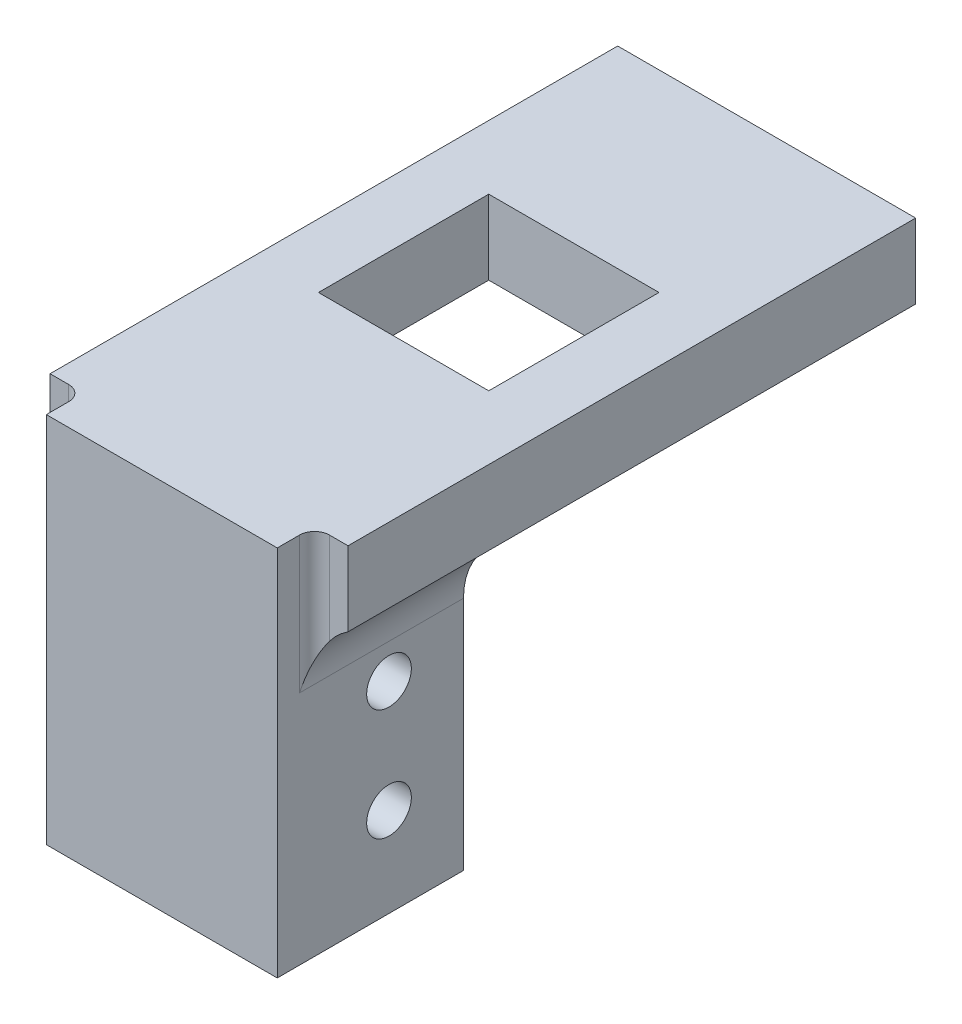
ISO-10303-21;
HEADER;
FILE_DESCRIPTION(('STEP AP214'),'2;1');
FILE_NAME('part.step','',(''),(''),'','','');
FILE_SCHEMA(('AUTOMOTIVE_DESIGN { 1 0 10303 214 1 1 1 1 }'));
ENDSEC;
DATA;
#1=APPLICATION_CONTEXT('core data for automotive mechanical design processes');
#2=APPLICATION_PROTOCOL_DEFINITION('international standard','automotive_design',2000,#1);
#3=PRODUCT_CONTEXT('',#1,'mechanical');
#4=PRODUCT('Part','Part','',(#3));
#5=PRODUCT_RELATED_PRODUCT_CATEGORY('part','',(#4));
#6=PRODUCT_DEFINITION_FORMATION('','',#4);
#7=PRODUCT_DEFINITION_CONTEXT('part definition',#1,'design');
#8=PRODUCT_DEFINITION('design','',#6,#7);
#9=PRODUCT_DEFINITION_SHAPE('','',#8);
#10=(LENGTH_UNIT() NAMED_UNIT(*) SI_UNIT(.MILLI.,.METRE.));
#11=(NAMED_UNIT(*) PLANE_ANGLE_UNIT() SI_UNIT($,.RADIAN.));
#12=(NAMED_UNIT(*) SI_UNIT($,.STERADIAN.) SOLID_ANGLE_UNIT());
#13=UNCERTAINTY_MEASURE_WITH_UNIT(LENGTH_MEASURE(1.E-05),#10,'distance_accuracy_value','');
#14=(GEOMETRIC_REPRESENTATION_CONTEXT(3) GLOBAL_UNCERTAINTY_ASSIGNED_CONTEXT((#13)) GLOBAL_UNIT_ASSIGNED_CONTEXT((#10,
#11,#12)) REPRESENTATION_CONTEXT('',''));
#15=CARTESIAN_POINT('',(0.,0.,0.));
#16=DIRECTION('',(0.,0.,1.));
#17=DIRECTION('',(1.,0.,0.));
#18=AXIS2_PLACEMENT_3D('',#15,#16,#17);
#19=CARTESIAN_POINT('',(20.,314.8,40.405));
#20=DIRECTION('',(0.,0.,-1.));
#21=DIRECTION('',(-1.,0.,0.));
#22=AXIS2_PLACEMENT_3D('',#19,#20,#21);
#23=PLANE('',#22);
#24=CARTESIAN_POINT('',(-25.5,296.448353455755,40.405));
#25=DIRECTION('',(0.,0.,-1.));
#26=DIRECTION('',(-1.,0.,0.));
#27=AXIS2_PLACEMENT_3D('',#24,#25,#26);
#28=CIRCLE('',#27,10.);
#29=CARTESIAN_POINT('',(-20.,304.8,40.405));
#30=VERTEX_POINT('',#29);
#31=CARTESIAN_POINT('',(-17.5,302.448353455755,40.405));
#32=VERTEX_POINT('',#31);
#33=EDGE_CURVE('E335',#30,#32,#28,.T.);
#34=ORIENTED_EDGE('',*,*,#33,.T.);
#35=DIRECTION('',(0.,-1.,0.));
#36=VECTOR('',#35,1.);
#37=CARTESIAN_POINT('',(-17.5,314.8,40.405));
#38=LINE('',#37,#36);
#39=CARTESIAN_POINT('',(-17.5,314.8,40.405));
#40=VERTEX_POINT('',#39);
#41=EDGE_CURVE('E65',#32,#40,#38,.F.);
#42=ORIENTED_EDGE('',*,*,#41,.T.);
#43=DIRECTION('',(1.,0.,0.));
#44=VECTOR('',#43,1.);
#45=CARTESIAN_POINT('',(20.,314.8,40.405));
#46=LINE('',#45,#44);
#47=CARTESIAN_POINT('',(-20.,314.8,40.405));
#48=VERTEX_POINT('',#47);
#49=EDGE_CURVE('E295',#48,#40,#46,.T.);
#50=ORIENTED_EDGE('',*,*,#49,.F.);
#51=DIRECTION('',(0.,-1.,0.));
#52=VECTOR('',#51,1.);
#53=CARTESIAN_POINT('',(-20.,314.8,40.405));
#54=LINE('',#53,#52);
#55=EDGE_CURVE('E304',#48,#30,#54,.T.);
#56=ORIENTED_EDGE('',*,*,#55,.T.);
#57=EDGE_LOOP('',(#34,#42,#50,#56));
#58=FACE_BOUND('',#57,.T.);
#59=ADVANCED_FACE('F43',(#58),#23,.F.);
#60=CARTESIAN_POINT('',(17.5,314.8,40.405));
#61=VERTEX_POINT('',#60);
#62=CARTESIAN_POINT('',(20.,314.8,40.405));
#63=VERTEX_POINT('',#62);
#64=EDGE_CURVE('E298',#61,#63,#46,.T.);
#65=ORIENTED_EDGE('',*,*,#64,.F.);
#66=DIRECTION('',(0.,1.,0.));
#67=VECTOR('',#66,1.);
#68=CARTESIAN_POINT('',(17.5,296.448353455755,40.405));
#69=LINE('',#68,#67);
#70=CARTESIAN_POINT('',(17.5,302.448353455755,40.405));
#71=VERTEX_POINT('',#70);
#72=EDGE_CURVE('E353',#61,#71,#69,.F.);
#73=ORIENTED_EDGE('',*,*,#72,.T.);
#74=CARTESIAN_POINT('',(25.5,296.448353455755,40.405));
#75=DIRECTION('',(0.,0.,-1.));
#76=DIRECTION('',(-1.,0.,0.));
#77=AXIS2_PLACEMENT_3D('',#74,#75,#76);
#78=CIRCLE('',#77,10.);
#79=CARTESIAN_POINT('',(20.,304.8,40.405));
#80=VERTEX_POINT('',#79);
#81=EDGE_CURVE('E337',#71,#80,#78,.T.);
#82=ORIENTED_EDGE('',*,*,#81,.T.);
#83=DIRECTION('',(0.,-1.,0.));
#84=VECTOR('',#83,1.);
#85=CARTESIAN_POINT('',(20.,314.8,40.405));
#86=LINE('',#85,#84);
#87=EDGE_CURVE('E325',#63,#80,#86,.T.);
#88=ORIENTED_EDGE('',*,*,#87,.F.);
#89=EDGE_LOOP('',(#65,#73,#82,#88));
#90=FACE_BOUND('',#89,.T.);
#91=ADVANCED_FACE('F392',(#90),#23,.F.);
#92=CARTESIAN_POINT('',(0.,314.8,0.));
#93=DIRECTION('',(0.,-1.,0.));
#94=DIRECTION('',(0.,0.,-1.));
#95=AXIS2_PLACEMENT_3D('',#92,#93,#94);
#96=PLANE('',#95);
#97=ORIENTED_EDGE('',*,*,#49,.T.);
#98=CARTESIAN_POINT('',(-17.5,314.8,42.405));
#99=DIRECTION('',(0.,-1.,0.));
#100=DIRECTION('',(0.,0.,-1.));
#101=AXIS2_PLACEMENT_3D('',#98,#99,#100);
#102=CIRCLE('',#101,2.);
#103=CARTESIAN_POINT('',(-15.5,314.8,42.405));
#104=VERTEX_POINT('',#103);
#105=EDGE_CURVE('E11',#40,#104,#102,.T.);
#106=ORIENTED_EDGE('',*,*,#105,.T.);
#107=DIRECTION('',(0.,0.,-1.));
#108=VECTOR('',#107,1.);
#109=CARTESIAN_POINT('',(-15.5,314.8,45.405));
#110=LINE('',#109,#108);
#111=CARTESIAN_POINT('',(-15.5,314.8,45.405));
#112=VERTEX_POINT('',#111);
#113=EDGE_CURVE('E223',#112,#104,#110,.T.);
#114=ORIENTED_EDGE('',*,*,#113,.F.);
#115=DIRECTION('',(-1.,0.,0.));
#116=VECTOR('',#115,1.);
#117=CARTESIAN_POINT('',(-15.5,314.8,45.405));
#118=LINE('',#117,#116);
#119=CARTESIAN_POINT('',(15.5,314.8,45.405));
#120=VERTEX_POINT('',#119);
#121=EDGE_CURVE('E212',#120,#112,#118,.T.);
#122=ORIENTED_EDGE('',*,*,#121,.F.);
#123=DIRECTION('',(0.,0.,-1.));
#124=VECTOR('',#123,1.);
#125=CARTESIAN_POINT('',(15.5,314.8,45.405));
#126=LINE('',#125,#124);
#127=CARTESIAN_POINT('',(15.5,314.8,42.405));
#128=VERTEX_POINT('',#127);
#129=EDGE_CURVE('E226',#120,#128,#126,.T.);
#130=ORIENTED_EDGE('',*,*,#129,.T.);
#131=CARTESIAN_POINT('',(17.5,314.8,42.405));
#132=DIRECTION('',(0.,-1.,0.));
#133=DIRECTION('',(0.,0.,-1.));
#134=AXIS2_PLACEMENT_3D('',#131,#132,#133);
#135=CIRCLE('',#134,2.);
#136=EDGE_CURVE('E359',#128,#61,#135,.T.);
#137=ORIENTED_EDGE('',*,*,#136,.T.);
#138=ORIENTED_EDGE('',*,*,#64,.T.);
#139=DIRECTION('',(0.,0.,-1.));
#140=VECTOR('',#139,1.);
#141=CARTESIAN_POINT('',(20.,314.8,-35.795));
#142=LINE('',#141,#140);
#143=CARTESIAN_POINT('',(20.,314.8,-35.795));
#144=VERTEX_POINT('',#143);
#145=EDGE_CURVE('E297',#63,#144,#142,.T.);
#146=ORIENTED_EDGE('',*,*,#145,.T.);
#147=DIRECTION('',(-1.,0.,0.));
#148=VECTOR('',#147,1.);
#149=CARTESIAN_POINT('',(-20.,314.8,-35.795));
#150=LINE('',#149,#148);
#151=CARTESIAN_POINT('',(-20.,314.8,-35.795));
#152=VERTEX_POINT('',#151);
#153=EDGE_CURVE('E300',#144,#152,#150,.T.);
#154=ORIENTED_EDGE('',*,*,#153,.T.);
#155=DIRECTION('',(0.,0.,1.));
#156=VECTOR('',#155,1.);
#157=CARTESIAN_POINT('',(-20.,314.8,40.405));
#158=LINE('',#157,#156);
#159=EDGE_CURVE('E302',#152,#48,#158,.T.);
#160=ORIENTED_EDGE('',*,*,#159,.T.);
#161=EDGE_LOOP('',(#97,#106,#114,#122,#130,#137,#138,#146,#154,#160));
#162=FACE_BOUND('',#161,.T.);
#163=DIRECTION('',(0.,0.,1.));
#164=VECTOR('',#163,1.);
#165=CARTESIAN_POINT('',(-11.43,314.8,-9.91500000000002));
#166=LINE('',#165,#164);
#167=CARTESIAN_POINT('',(-11.43,314.8,-9.91500000000002));
#168=VERTEX_POINT('',#167);
#169=CARTESIAN_POINT('',(-11.43,314.8,12.945));
#170=VERTEX_POINT('',#169);
#171=EDGE_CURVE('E264',#168,#170,#166,.T.);
#172=ORIENTED_EDGE('',*,*,#171,.F.);
#173=DIRECTION('',(-1.,0.,0.));
#174=VECTOR('',#173,1.);
#175=CARTESIAN_POINT('',(-11.43,314.8,-9.91500000000002));
#176=LINE('',#175,#174);
#177=CARTESIAN_POINT('',(11.43,314.8,-9.91500000000002));
#178=VERTEX_POINT('',#177);
#179=EDGE_CURVE('E272',#178,#168,#176,.T.);
#180=ORIENTED_EDGE('',*,*,#179,.F.);
#181=DIRECTION('',(0.,0.,-1.));
#182=VECTOR('',#181,1.);
#183=CARTESIAN_POINT('',(11.43,314.8,-9.91500000000002));
#184=LINE('',#183,#182);
#185=CARTESIAN_POINT('',(11.43,314.8,12.945));
#186=VERTEX_POINT('',#185);
#187=EDGE_CURVE('E269',#186,#178,#184,.T.);
#188=ORIENTED_EDGE('',*,*,#187,.F.);
#189=DIRECTION('',(1.,0.,0.));
#190=VECTOR('',#189,1.);
#191=CARTESIAN_POINT('',(-11.43,314.8,12.945));
#192=LINE('',#191,#190);
#193=EDGE_CURVE('E266',#170,#186,#192,.T.);
#194=ORIENTED_EDGE('',*,*,#193,.F.);
#195=EDGE_LOOP('',(#172,#180,#188,#194));
#196=FACE_BOUND('',#195,.T.);
#197=ADVANCED_FACE('F399',(#162,#196),#96,.F.);
#198=CARTESIAN_POINT('',(0.,304.8,0.));
#199=DIRECTION('',(0.,-1.,0.));
#200=DIRECTION('',(0.,0.,-1.));
#201=AXIS2_PLACEMENT_3D('',#198,#199,#200);
#202=PLANE('',#201);
#203=DIRECTION('',(1.,0.,0.));
#204=VECTOR('',#203,1.);
#205=CARTESIAN_POINT('',(-15.5,304.8,20.405));
#206=LINE('',#205,#204);
#207=CARTESIAN_POINT('',(-20.,304.8,20.405));
#208=VERTEX_POINT('',#207);
#209=CARTESIAN_POINT('',(-10.,304.8,20.405));
#210=VERTEX_POINT('',#209);
#211=EDGE_CURVE('E234',#208,#210,#206,.T.);
#212=ORIENTED_EDGE('',*,*,#211,.F.);
#213=DIRECTION('',(0.,0.,1.));
#214=VECTOR('',#213,1.);
#215=CARTESIAN_POINT('',(-20.,304.8,40.405));
#216=LINE('',#215,#214);
#217=CARTESIAN_POINT('',(-20.,304.8,-35.795));
#218=VERTEX_POINT('',#217);
#219=EDGE_CURVE('E314',#218,#208,#216,.T.);
#220=ORIENTED_EDGE('',*,*,#219,.F.);
#221=DIRECTION('',(-1.,0.,0.));
#222=VECTOR('',#221,1.);
#223=CARTESIAN_POINT('',(-20.,304.8,-35.795));
#224=LINE('',#223,#222);
#225=CARTESIAN_POINT('',(20.,304.8,-35.795));
#226=VERTEX_POINT('',#225);
#227=EDGE_CURVE('E311',#226,#218,#224,.T.);
#228=ORIENTED_EDGE('',*,*,#227,.F.);
#229=DIRECTION('',(0.,0.,-1.));
#230=VECTOR('',#229,1.);
#231=CARTESIAN_POINT('',(20.,304.8,-35.795));
#232=LINE('',#231,#230);
#233=CARTESIAN_POINT('',(20.,304.8,20.405));
#234=VERTEX_POINT('',#233);
#235=EDGE_CURVE('E307',#234,#226,#232,.T.);
#236=ORIENTED_EDGE('',*,*,#235,.F.);
#237=DIRECTION('',(1.,0.,0.));
#238=VECTOR('',#237,1.);
#239=CARTESIAN_POINT('',(15.5,304.8,20.405));
#240=LINE('',#239,#238);
#241=CARTESIAN_POINT('',(10.,304.8,20.405));
#242=VERTEX_POINT('',#241);
#243=EDGE_CURVE('E256',#242,#234,#240,.T.);
#244=ORIENTED_EDGE('',*,*,#243,.F.);
#245=DIRECTION('',(0.,0.,-1.));
#246=VECTOR('',#245,1.);
#247=CARTESIAN_POINT('',(10.,304.8,40.405));
#248=LINE('',#247,#246);
#249=CARTESIAN_POINT('',(10.,304.8,40.405));
#250=VERTEX_POINT('',#249);
#251=EDGE_CURVE('E237',#250,#242,#248,.T.);
#252=ORIENTED_EDGE('',*,*,#251,.F.);
#253=DIRECTION('',(1.,0.,0.));
#254=VECTOR('',#253,1.);
#255=CARTESIAN_POINT('',(20.,304.8,40.405));
#256=LINE('',#255,#254);
#257=CARTESIAN_POINT('',(-10.,304.8,40.405));
#258=VERTEX_POINT('',#257);
#259=EDGE_CURVE('E294',#258,#250,#256,.T.);
#260=ORIENTED_EDGE('',*,*,#259,.F.);
#261=DIRECTION('',(0.,0.,1.));
#262=VECTOR('',#261,1.);
#263=CARTESIAN_POINT('',(-10.,304.8,40.405));
#264=LINE('',#263,#262);
#265=EDGE_CURVE('E199',#210,#258,#264,.T.);
#266=ORIENTED_EDGE('',*,*,#265,.F.);
#267=EDGE_LOOP('',(#212,#220,#228,#236,#244,#252,#260,#266));
#268=FACE_BOUND('',#267,.T.);
#269=DIRECTION('',(-1.,0.,0.));
#270=VECTOR('',#269,1.);
#271=CARTESIAN_POINT('',(-11.43,304.8,-9.91500000000002));
#272=LINE('',#271,#270);
#273=CARTESIAN_POINT('',(11.43,304.8,-9.91500000000002));
#274=VERTEX_POINT('',#273);
#275=CARTESIAN_POINT('',(-11.43,304.8,-9.91500000000002));
#276=VERTEX_POINT('',#275);
#277=EDGE_CURVE('E267',#274,#276,#272,.T.);
#278=ORIENTED_EDGE('',*,*,#277,.T.);
#279=DIRECTION('',(0.,0.,1.));
#280=VECTOR('',#279,1.);
#281=CARTESIAN_POINT('',(-11.43,304.8,-9.91500000000002));
#282=LINE('',#281,#280);
#283=CARTESIAN_POINT('',(-11.43,304.8,12.945));
#284=VERTEX_POINT('',#283);
#285=EDGE_CURVE('E246',#276,#284,#282,.T.);
#286=ORIENTED_EDGE('',*,*,#285,.T.);
#287=DIRECTION('',(1.,0.,0.));
#288=VECTOR('',#287,1.);
#289=CARTESIAN_POINT('',(-11.43,304.8,12.945));
#290=LINE('',#289,#288);
#291=CARTESIAN_POINT('',(11.43,304.8,12.945));
#292=VERTEX_POINT('',#291);
#293=EDGE_CURVE('E277',#284,#292,#290,.T.);
#294=ORIENTED_EDGE('',*,*,#293,.T.);
#295=DIRECTION('',(0.,0.,-1.));
#296=VECTOR('',#295,1.);
#297=CARTESIAN_POINT('',(11.43,304.8,-9.91500000000002));
#298=LINE('',#297,#296);
#299=EDGE_CURVE('E280',#292,#274,#298,.T.);
#300=ORIENTED_EDGE('',*,*,#299,.T.);
#301=EDGE_LOOP('',(#278,#286,#294,#300));
#302=FACE_BOUND('',#301,.T.);
#303=ADVANCED_FACE('F463',(#268,#302),#202,.T.);
#304=CARTESIAN_POINT('',(20.,314.8,-35.795));
#305=DIRECTION('',(-1.,0.,0.));
#306=DIRECTION('',(0.,0.,1.));
#307=AXIS2_PLACEMENT_3D('',#304,#305,#306);
#308=PLANE('',#307);
#309=EDGE_CURVE('E308',#80,#234,#232,.T.);
#310=ORIENTED_EDGE('',*,*,#309,.T.);
#311=ORIENTED_EDGE('',*,*,#235,.T.);
#312=DIRECTION('',(0.,-1.,0.));
#313=VECTOR('',#312,1.);
#314=CARTESIAN_POINT('',(20.,314.8,-35.795));
#315=LINE('',#314,#313);
#316=EDGE_CURVE('E322',#144,#226,#315,.T.);
#317=ORIENTED_EDGE('',*,*,#316,.F.);
#318=ORIENTED_EDGE('',*,*,#145,.F.);
#319=ORIENTED_EDGE('',*,*,#87,.T.);
#320=EDGE_LOOP('',(#310,#311,#317,#318,#319));
#321=FACE_BOUND('',#320,.T.);
#322=ADVANCED_FACE('F402',(#321),#308,.F.);
#323=CARTESIAN_POINT('',(-20.,314.8,-35.795));
#324=DIRECTION('',(0.,0.,1.));
#325=DIRECTION('',(1.,0.,0.));
#326=AXIS2_PLACEMENT_3D('',#323,#324,#325);
#327=PLANE('',#326);
#328=ORIENTED_EDGE('',*,*,#227,.T.);
#329=DIRECTION('',(0.,-1.,0.));
#330=VECTOR('',#329,1.);
#331=CARTESIAN_POINT('',(-20.,314.8,-35.795));
#332=LINE('',#331,#330);
#333=EDGE_CURVE('E319',#152,#218,#332,.T.);
#334=ORIENTED_EDGE('',*,*,#333,.F.);
#335=ORIENTED_EDGE('',*,*,#153,.F.);
#336=ORIENTED_EDGE('',*,*,#316,.T.);
#337=EDGE_LOOP('',(#328,#334,#335,#336));
#338=FACE_BOUND('',#337,.T.);
#339=ADVANCED_FACE('F457',(#338),#327,.F.);
#340=CARTESIAN_POINT('',(-20.,314.8,40.405));
#341=DIRECTION('',(1.,0.,0.));
#342=DIRECTION('',(0.,0.,-1.));
#343=AXIS2_PLACEMENT_3D('',#340,#341,#342);
#344=PLANE('',#343);
#345=ORIENTED_EDGE('',*,*,#219,.T.);
#346=EDGE_CURVE('E313',#208,#30,#216,.T.);
#347=ORIENTED_EDGE('',*,*,#346,.T.);
#348=ORIENTED_EDGE('',*,*,#55,.F.);
#349=ORIENTED_EDGE('',*,*,#159,.F.);
#350=ORIENTED_EDGE('',*,*,#333,.T.);
#351=EDGE_LOOP('',(#345,#347,#348,#349,#350));
#352=FACE_BOUND('',#351,.T.);
#353=ADVANCED_FACE('F461',(#352),#344,.F.);
#354=CARTESIAN_POINT('',(-11.43,314.8,-9.91500000000002));
#355=DIRECTION('',(1.,0.,0.));
#356=DIRECTION('',(0.,0.,-1.));
#357=AXIS2_PLACEMENT_3D('',#354,#355,#356);
#358=PLANE('',#357);
#359=ORIENTED_EDGE('',*,*,#285,.F.);
#360=DIRECTION('',(0.,-1.,0.));
#361=VECTOR('',#360,1.);
#362=CARTESIAN_POINT('',(-11.43,314.8,-9.91500000000002));
#363=LINE('',#362,#361);
#364=EDGE_CURVE('E274',#168,#276,#363,.T.);
#365=ORIENTED_EDGE('',*,*,#364,.F.);
#366=ORIENTED_EDGE('',*,*,#171,.T.);
#367=DIRECTION('',(0.,-1.,0.));
#368=VECTOR('',#367,1.);
#369=CARTESIAN_POINT('',(-11.43,314.8,12.945));
#370=LINE('',#369,#368);
#371=EDGE_CURVE('E291',#170,#284,#370,.T.);
#372=ORIENTED_EDGE('',*,*,#371,.T.);
#373=EDGE_LOOP('',(#359,#365,#366,#372));
#374=FACE_BOUND('',#373,.T.);
#375=ADVANCED_FACE('F476',(#374),#358,.T.);
#376=CARTESIAN_POINT('',(-11.43,314.8,12.945));
#377=DIRECTION('',(0.,0.,-1.));
#378=DIRECTION('',(-1.,0.,0.));
#379=AXIS2_PLACEMENT_3D('',#376,#377,#378);
#380=PLANE('',#379);
#381=ORIENTED_EDGE('',*,*,#293,.F.);
#382=ORIENTED_EDGE('',*,*,#371,.F.);
#383=ORIENTED_EDGE('',*,*,#193,.T.);
#384=DIRECTION('',(0.,-1.,0.));
#385=VECTOR('',#384,1.);
#386=CARTESIAN_POINT('',(11.43,314.8,12.945));
#387=LINE('',#386,#385);
#388=EDGE_CURVE('E289',#186,#292,#387,.T.);
#389=ORIENTED_EDGE('',*,*,#388,.T.);
#390=EDGE_LOOP('',(#381,#382,#383,#389));
#391=FACE_BOUND('',#390,.T.);
#392=ADVANCED_FACE('F482',(#391),#380,.T.);
#393=CARTESIAN_POINT('',(11.43,314.8,-9.91500000000002));
#394=DIRECTION('',(-1.,0.,0.));
#395=DIRECTION('',(0.,0.,1.));
#396=AXIS2_PLACEMENT_3D('',#393,#394,#395);
#397=PLANE('',#396);
#398=ORIENTED_EDGE('',*,*,#299,.F.);
#399=ORIENTED_EDGE('',*,*,#388,.F.);
#400=ORIENTED_EDGE('',*,*,#187,.T.);
#401=DIRECTION('',(0.,-1.,0.));
#402=VECTOR('',#401,1.);
#403=CARTESIAN_POINT('',(11.43,314.8,-9.91500000000002));
#404=LINE('',#403,#402);
#405=EDGE_CURVE('E287',#178,#274,#404,.T.);
#406=ORIENTED_EDGE('',*,*,#405,.T.);
#407=EDGE_LOOP('',(#398,#399,#400,#406));
#408=FACE_BOUND('',#407,.T.);
#409=ADVANCED_FACE('F484',(#408),#397,.T.);
#410=CARTESIAN_POINT('',(-11.43,314.8,-9.91500000000002));
#411=DIRECTION('',(0.,0.,1.));
#412=DIRECTION('',(1.,0.,0.));
#413=AXIS2_PLACEMENT_3D('',#410,#411,#412);
#414=PLANE('',#413);
#415=ORIENTED_EDGE('',*,*,#277,.F.);
#416=ORIENTED_EDGE('',*,*,#405,.F.);
#417=ORIENTED_EDGE('',*,*,#179,.T.);
#418=ORIENTED_EDGE('',*,*,#364,.T.);
#419=EDGE_LOOP('',(#415,#416,#417,#418));
#420=FACE_BOUND('',#419,.T.);
#421=ADVANCED_FACE('F471',(#420),#414,.T.);
#422=CARTESIAN_POINT('',(15.5,264.8,40.405));
#423=DIRECTION('',(-1.,0.,0.));
#424=DIRECTION('',(0.,0.,1.));
#425=AXIS2_PLACEMENT_3D('',#422,#423,#424);
#426=PLANE('',#425);
#427=CARTESIAN_POINT('',(15.5,276.8,30.405));
#428=DIRECTION('',(-1.,0.,0.));
#429=DIRECTION('',(0.,0.,1.));
#430=AXIS2_PLACEMENT_3D('',#427,#428,#429);
#431=CIRCLE('',#430,3.);
#432=CARTESIAN_POINT('',(15.5,276.8,33.405));
#433=VERTEX_POINT('',#432);
#434=EDGE_CURVE('E217',#433,#433,#431,.T.);
#435=ORIENTED_EDGE('',*,*,#434,.T.);
#436=EDGE_LOOP('',(#435));
#437=FACE_BOUND('',#436,.T.);
#438=CARTESIAN_POINT('',(15.5,291.8,30.405));
#439=DIRECTION('',(-1.,0.,0.));
#440=DIRECTION('',(0.,0.,1.));
#441=AXIS2_PLACEMENT_3D('',#438,#439,#440);
#442=CIRCLE('',#441,3.);
#443=CARTESIAN_POINT('',(15.5,291.8,33.405));
#444=VERTEX_POINT('',#443);
#445=EDGE_CURVE('E350',#444,#444,#442,.T.);
#446=ORIENTED_EDGE('',*,*,#445,.T.);
#447=EDGE_LOOP('',(#446));
#448=FACE_BOUND('',#447,.T.);
#449=DIRECTION('',(0.,0.,-1.));
#450=VECTOR('',#449,1.);
#451=CARTESIAN_POINT('',(15.5,296.448353455755,40.405));
#452=LINE('',#451,#450);
#453=CARTESIAN_POINT('',(15.5,296.448353455755,20.405));
#454=VERTEX_POINT('',#453);
#455=CARTESIAN_POINT('',(15.5,296.448353455755,42.405));
#456=VERTEX_POINT('',#455);
#457=EDGE_CURVE('E330',#454,#456,#452,.F.);
#458=ORIENTED_EDGE('',*,*,#457,.T.);
#459=DIRECTION('',(0.,1.,0.));
#460=VECTOR('',#459,1.);
#461=CARTESIAN_POINT('',(15.5,314.8,42.405));
#462=LINE('',#461,#460);
#463=EDGE_CURVE('E341',#456,#128,#462,.T.);
#464=ORIENTED_EDGE('',*,*,#463,.T.);
#465=ORIENTED_EDGE('',*,*,#129,.F.);
#466=DIRECTION('',(0.,1.,0.));
#467=VECTOR('',#466,1.);
#468=CARTESIAN_POINT('',(15.5,314.8,45.405));
#469=LINE('',#468,#467);
#470=CARTESIAN_POINT('',(15.5,264.8,45.405));
#471=VERTEX_POINT('',#470);
#472=EDGE_CURVE('E208',#471,#120,#469,.T.);
#473=ORIENTED_EDGE('',*,*,#472,.F.);
#474=DIRECTION('',(0.,0.,1.));
#475=VECTOR('',#474,1.);
#476=CARTESIAN_POINT('',(15.5,264.8,40.405));
#477=LINE('',#476,#475);
#478=CARTESIAN_POINT('',(15.5,264.8,20.405));
#479=VERTEX_POINT('',#478);
#480=EDGE_CURVE('E205',#479,#471,#477,.T.);
#481=ORIENTED_EDGE('',*,*,#480,.F.);
#482=DIRECTION('',(0.,1.,0.));
#483=VECTOR('',#482,1.);
#484=CARTESIAN_POINT('',(15.5,264.8,20.405));
#485=LINE('',#484,#483);
#486=EDGE_CURVE('E252',#479,#454,#485,.T.);
#487=ORIENTED_EDGE('',*,*,#486,.T.);
#488=EDGE_LOOP('',(#458,#464,#465,#473,#481,#487));
#489=FACE_BOUND('',#488,.T.);
#490=ADVANCED_FACE('F442',(#437,#448,#489),#426,.F.);
#491=CARTESIAN_POINT('',(10.,264.8,40.405));
#492=DIRECTION('',(1.,0.,0.));
#493=DIRECTION('',(0.,0.,-1.));
#494=AXIS2_PLACEMENT_3D('',#491,#492,#493);
#495=PLANE('',#494);
#496=CARTESIAN_POINT('',(10.,276.8,30.405));
#497=DIRECTION('',(1.,0.,0.));
#498=DIRECTION('',(0.,0.,-1.));
#499=AXIS2_PLACEMENT_3D('',#496,#497,#498);
#500=CIRCLE('',#499,3.);
#501=CARTESIAN_POINT('',(10.,276.8,27.405));
#502=VERTEX_POINT('',#501);
#503=EDGE_CURVE('E716',#502,#502,#500,.T.);
#504=ORIENTED_EDGE('',*,*,#503,.T.);
#505=EDGE_LOOP('',(#504));
#506=FACE_BOUND('',#505,.T.);
#507=CARTESIAN_POINT('',(10.,291.8,30.405));
#508=DIRECTION('',(1.,0.,0.));
#509=DIRECTION('',(0.,0.,-1.));
#510=AXIS2_PLACEMENT_3D('',#507,#508,#509);
#511=CIRCLE('',#510,3.);
#512=CARTESIAN_POINT('',(10.,291.8,27.405));
#513=VERTEX_POINT('',#512);
#514=EDGE_CURVE('E707',#513,#513,#511,.T.);
#515=ORIENTED_EDGE('',*,*,#514,.T.);
#516=EDGE_LOOP('',(#515));
#517=FACE_BOUND('',#516,.T.);
#518=ORIENTED_EDGE('',*,*,#251,.T.);
#519=DIRECTION('',(0.,1.,0.));
#520=VECTOR('',#519,1.);
#521=CARTESIAN_POINT('',(10.,264.8,20.405));
#522=LINE('',#521,#520);
#523=CARTESIAN_POINT('',(10.,264.8,20.405));
#524=VERTEX_POINT('',#523);
#525=EDGE_CURVE('E249',#524,#242,#522,.T.);
#526=ORIENTED_EDGE('',*,*,#525,.F.);
#527=DIRECTION('',(0.,0.,-1.));
#528=VECTOR('',#527,1.);
#529=CARTESIAN_POINT('',(10.,264.8,40.405));
#530=LINE('',#529,#528);
#531=CARTESIAN_POINT('',(10.,264.8,40.405));
#532=VERTEX_POINT('',#531);
#533=EDGE_CURVE('E261',#532,#524,#530,.T.);
#534=ORIENTED_EDGE('',*,*,#533,.F.);
#535=DIRECTION('',(0.,1.,0.));
#536=VECTOR('',#535,1.);
#537=CARTESIAN_POINT('',(10.,264.8,40.405));
#538=LINE('',#537,#536);
#539=EDGE_CURVE('E228',#532,#250,#538,.T.);
#540=ORIENTED_EDGE('',*,*,#539,.T.);
#541=EDGE_LOOP('',(#518,#526,#534,#540));
#542=FACE_BOUND('',#541,.T.);
#543=ADVANCED_FACE('F433',(#506,#517,#542),#495,.F.);
#544=CARTESIAN_POINT('',(15.5,264.8,20.405));
#545=DIRECTION('',(0.,0.,1.));
#546=DIRECTION('',(1.,0.,0.));
#547=AXIS2_PLACEMENT_3D('',#544,#545,#546);
#548=PLANE('',#547);
#549=ORIENTED_EDGE('',*,*,#243,.T.);
#550=CARTESIAN_POINT('',(25.5,296.448353455755,20.405));
#551=DIRECTION('',(0.,0.,1.));
#552=DIRECTION('',(1.,0.,0.));
#553=AXIS2_PLACEMENT_3D('',#550,#551,#552);
#554=CIRCLE('',#553,10.);
#555=EDGE_CURVE('E339',#234,#454,#554,.T.);
#556=ORIENTED_EDGE('',*,*,#555,.T.);
#557=ORIENTED_EDGE('',*,*,#486,.F.);
#558=DIRECTION('',(1.,0.,0.));
#559=VECTOR('',#558,1.);
#560=CARTESIAN_POINT('',(15.5,264.8,20.405));
#561=LINE('',#560,#559);
#562=EDGE_CURVE('E255',#524,#479,#561,.T.);
#563=ORIENTED_EDGE('',*,*,#562,.F.);
#564=ORIENTED_EDGE('',*,*,#525,.T.);
#565=EDGE_LOOP('',(#549,#556,#557,#563,#564));
#566=FACE_BOUND('',#565,.T.);
#567=ADVANCED_FACE('F438',(#566),#548,.F.);
#568=CARTESIAN_POINT('',(-15.5,264.8,40.405));
#569=DIRECTION('',(1.,0.,0.));
#570=DIRECTION('',(0.,0.,-1.));
#571=AXIS2_PLACEMENT_3D('',#568,#569,#570);
#572=PLANE('',#571);
#573=CARTESIAN_POINT('',(-15.5,276.8,30.405));
#574=DIRECTION('',(1.,0.,0.));
#575=DIRECTION('',(0.,0.,-1.));
#576=AXIS2_PLACEMENT_3D('',#573,#574,#575);
#577=CIRCLE('',#576,3.);
#578=CARTESIAN_POINT('',(-15.5,276.8,27.405));
#579=VERTEX_POINT('',#578);
#580=EDGE_CURVE('E349',#579,#579,#577,.T.);
#581=ORIENTED_EDGE('',*,*,#580,.T.);
#582=EDGE_LOOP('',(#581));
#583=FACE_BOUND('',#582,.T.);
#584=CARTESIAN_POINT('',(-15.5,291.8,30.405));
#585=DIRECTION('',(1.,0.,0.));
#586=DIRECTION('',(0.,0.,-1.));
#587=AXIS2_PLACEMENT_3D('',#584,#585,#586);
#588=CIRCLE('',#587,3.);
#589=CARTESIAN_POINT('',(-15.5,291.8,27.405));
#590=VERTEX_POINT('',#589);
#591=EDGE_CURVE('E345',#590,#590,#588,.T.);
#592=ORIENTED_EDGE('',*,*,#591,.T.);
#593=EDGE_LOOP('',(#592));
#594=FACE_BOUND('',#593,.T.);
#595=ORIENTED_EDGE('',*,*,#113,.T.);
#596=DIRECTION('',(0.,-1.,0.));
#597=VECTOR('',#596,1.);
#598=CARTESIAN_POINT('',(-15.5,296.448353455755,42.405));
#599=LINE('',#598,#597);
#600=CARTESIAN_POINT('',(-15.5,296.448353455755,42.405));
#601=VERTEX_POINT('',#600);
#602=EDGE_CURVE('E355',#104,#601,#599,.T.);
#603=ORIENTED_EDGE('',*,*,#602,.T.);
#604=DIRECTION('',(0.,0.,1.));
#605=VECTOR('',#604,1.);
#606=CARTESIAN_POINT('',(-15.5,296.448353455755,40.405));
#607=LINE('',#606,#605);
#608=CARTESIAN_POINT('',(-15.5,296.448353455755,20.405));
#609=VERTEX_POINT('',#608);
#610=EDGE_CURVE('E328',#601,#609,#607,.F.);
#611=ORIENTED_EDGE('',*,*,#610,.T.);
#612=DIRECTION('',(0.,1.,0.));
#613=VECTOR('',#612,1.);
#614=CARTESIAN_POINT('',(-15.5,264.8,20.405));
#615=LINE('',#614,#613);
#616=CARTESIAN_POINT('',(-15.5,264.8,20.405));
#617=VERTEX_POINT('',#616);
#618=EDGE_CURVE('E196',#617,#609,#615,.T.);
#619=ORIENTED_EDGE('',*,*,#618,.F.);
#620=DIRECTION('',(0.,0.,-1.));
#621=VECTOR('',#620,1.);
#622=CARTESIAN_POINT('',(-15.5,264.8,40.405));
#623=LINE('',#622,#621);
#624=CARTESIAN_POINT('',(-15.5,264.8,45.405));
#625=VERTEX_POINT('',#624);
#626=EDGE_CURVE('E188',#625,#617,#623,.T.);
#627=ORIENTED_EDGE('',*,*,#626,.F.);
#628=DIRECTION('',(0.,-1.,0.));
#629=VECTOR('',#628,1.);
#630=CARTESIAN_POINT('',(-15.5,314.8,45.405));
#631=LINE('',#630,#629);
#632=EDGE_CURVE('E193',#112,#625,#631,.T.);
#633=ORIENTED_EDGE('',*,*,#632,.F.);
#634=EDGE_LOOP('',(#595,#603,#611,#619,#627,#633));
#635=FACE_BOUND('',#634,.T.);
#636=ADVANCED_FACE('F191',(#583,#594,#635),#572,.F.);
#637=CARTESIAN_POINT('',(-15.5,264.8,20.405));
#638=DIRECTION('',(0.,0.,1.));
#639=DIRECTION('',(1.,0.,0.));
#640=AXIS2_PLACEMENT_3D('',#637,#638,#639);
#641=PLANE('',#640);
#642=ORIENTED_EDGE('',*,*,#211,.T.);
#643=DIRECTION('',(0.,1.,0.));
#644=VECTOR('',#643,1.);
#645=CARTESIAN_POINT('',(-10.,264.8,20.405));
#646=LINE('',#645,#644);
#647=CARTESIAN_POINT('',(-10.,264.8,20.405));
#648=VERTEX_POINT('',#647);
#649=EDGE_CURVE('E242',#648,#210,#646,.T.);
#650=ORIENTED_EDGE('',*,*,#649,.F.);
#651=DIRECTION('',(1.,0.,0.));
#652=VECTOR('',#651,1.);
#653=CARTESIAN_POINT('',(-15.5,264.8,20.405));
#654=LINE('',#653,#652);
#655=EDGE_CURVE('E198',#617,#648,#654,.T.);
#656=ORIENTED_EDGE('',*,*,#655,.F.);
#657=ORIENTED_EDGE('',*,*,#618,.T.);
#658=CARTESIAN_POINT('',(-25.5,296.448353455755,20.405));
#659=DIRECTION('',(0.,0.,1.));
#660=DIRECTION('',(1.,0.,0.));
#661=AXIS2_PLACEMENT_3D('',#658,#659,#660);
#662=CIRCLE('',#661,10.);
#663=EDGE_CURVE('E332',#609,#208,#662,.T.);
#664=ORIENTED_EDGE('',*,*,#663,.T.);
#665=EDGE_LOOP('',(#642,#650,#656,#657,#664));
#666=FACE_BOUND('',#665,.T.);
#667=ADVANCED_FACE('F423',(#666),#641,.F.);
#668=CARTESIAN_POINT('',(-10.,264.8,40.405));
#669=DIRECTION('',(-1.,0.,0.));
#670=DIRECTION('',(0.,0.,1.));
#671=AXIS2_PLACEMENT_3D('',#668,#669,#670);
#672=PLANE('',#671);
#673=CARTESIAN_POINT('',(-10.,276.8,30.405));
#674=DIRECTION('',(-1.,0.,0.));
#675=DIRECTION('',(0.,0.,1.));
#676=AXIS2_PLACEMENT_3D('',#673,#674,#675);
#677=CIRCLE('',#676,3.);
#678=CARTESIAN_POINT('',(-10.,276.8,33.405));
#679=VERTEX_POINT('',#678);
#680=EDGE_CURVE('E346',#679,#679,#677,.T.);
#681=ORIENTED_EDGE('',*,*,#680,.T.);
#682=EDGE_LOOP('',(#681));
#683=FACE_BOUND('',#682,.T.);
#684=CARTESIAN_POINT('',(-10.,291.8,30.405));
#685=DIRECTION('',(-1.,0.,0.));
#686=DIRECTION('',(0.,0.,1.));
#687=AXIS2_PLACEMENT_3D('',#684,#685,#686);
#688=CIRCLE('',#687,3.);
#689=CARTESIAN_POINT('',(-10.,291.8,33.405));
#690=VERTEX_POINT('',#689);
#691=EDGE_CURVE('E342',#690,#690,#688,.T.);
#692=ORIENTED_EDGE('',*,*,#691,.T.);
#693=EDGE_LOOP('',(#692));
#694=FACE_BOUND('',#693,.T.);
#695=ORIENTED_EDGE('',*,*,#265,.T.);
#696=DIRECTION('',(0.,1.,0.));
#697=VECTOR('',#696,1.);
#698=CARTESIAN_POINT('',(-10.,264.8,40.405));
#699=LINE('',#698,#697);
#700=CARTESIAN_POINT('',(-10.,264.8,40.405));
#701=VERTEX_POINT('',#700);
#702=EDGE_CURVE('E233',#701,#258,#699,.T.);
#703=ORIENTED_EDGE('',*,*,#702,.F.);
#704=DIRECTION('',(0.,0.,1.));
#705=VECTOR('',#704,1.);
#706=CARTESIAN_POINT('',(-10.,264.8,40.405));
#707=LINE('',#706,#705);
#708=EDGE_CURVE('E231',#648,#701,#707,.T.);
#709=ORIENTED_EDGE('',*,*,#708,.F.);
#710=ORIENTED_EDGE('',*,*,#649,.T.);
#711=EDGE_LOOP('',(#695,#703,#709,#710));
#712=FACE_BOUND('',#711,.T.);
#713=ADVANCED_FACE('F429',(#683,#694,#712),#672,.F.);
#714=CARTESIAN_POINT('',(0.,264.8,0.));
#715=DIRECTION('',(0.,-1.,0.));
#716=DIRECTION('',(0.,0.,-1.));
#717=AXIS2_PLACEMENT_3D('',#714,#715,#716);
#718=PLANE('',#717);
#719=ORIENTED_EDGE('',*,*,#626,.T.);
#720=ORIENTED_EDGE('',*,*,#655,.T.);
#721=ORIENTED_EDGE('',*,*,#708,.T.);
#722=DIRECTION('',(1.,0.,0.));
#723=VECTOR('',#722,1.);
#724=CARTESIAN_POINT('',(-15.5,264.8,40.405));
#725=LINE('',#724,#723);
#726=EDGE_CURVE('E214',#701,#532,#725,.T.);
#727=ORIENTED_EDGE('',*,*,#726,.T.);
#728=ORIENTED_EDGE('',*,*,#533,.T.);
#729=ORIENTED_EDGE('',*,*,#562,.T.);
#730=ORIENTED_EDGE('',*,*,#480,.T.);
#731=DIRECTION('',(1.,0.,0.));
#732=VECTOR('',#731,1.);
#733=CARTESIAN_POINT('',(-15.5,264.8,45.405));
#734=LINE('',#733,#732);
#735=EDGE_CURVE('E202',#625,#471,#734,.T.);
#736=ORIENTED_EDGE('',*,*,#735,.F.);
#737=EDGE_LOOP('',(#719,#720,#721,#727,#728,#729,#730,#736));
#738=FACE_BOUND('',#737,.T.);
#739=ADVANCED_FACE('F203',(#738),#718,.T.);
#740=CARTESIAN_POINT('',(0.,0.,40.405));
#741=DIRECTION('',(0.,0.,1.));
#742=DIRECTION('',(1.,0.,0.));
#743=AXIS2_PLACEMENT_3D('',#740,#741,#742);
#744=PLANE('',#743);
#745=ORIENTED_EDGE('',*,*,#726,.F.);
#746=ORIENTED_EDGE('',*,*,#702,.T.);
#747=ORIENTED_EDGE('',*,*,#259,.T.);
#748=ORIENTED_EDGE('',*,*,#539,.F.);
#749=EDGE_LOOP('',(#745,#746,#747,#748));
#750=FACE_BOUND('',#749,.T.);
#751=ADVANCED_FACE('F414',(#750),#744,.F.);
#752=CARTESIAN_POINT('',(0.,0.,45.405));
#753=DIRECTION('',(0.,0.,1.));
#754=DIRECTION('',(1.,0.,0.));
#755=AXIS2_PLACEMENT_3D('',#752,#753,#754);
#756=PLANE('',#755);
#757=ORIENTED_EDGE('',*,*,#632,.T.);
#758=ORIENTED_EDGE('',*,*,#735,.T.);
#759=ORIENTED_EDGE('',*,*,#472,.T.);
#760=ORIENTED_EDGE('',*,*,#121,.T.);
#761=EDGE_LOOP('',(#757,#758,#759,#760));
#762=FACE_BOUND('',#761,.T.);
#763=ADVANCED_FACE('F210',(#762),#756,.T.);
#764=CARTESIAN_POINT('',(-25.5,296.448353455755,0.));
#765=DIRECTION('',(0.,0.,1.));
#766=DIRECTION('',(1.,0.,0.));
#767=AXIS2_PLACEMENT_3D('',#764,#765,#766);
#768=CYLINDRICAL_SURFACE('',#767,10.);
#769=ORIENTED_EDGE('',*,*,#33,.F.);
#770=ORIENTED_EDGE('',*,*,#346,.F.);
#771=ORIENTED_EDGE('',*,*,#663,.F.);
#772=ORIENTED_EDGE('',*,*,#610,.F.);
#773=CARTESIAN_POINT('',(-17.5,302.448353455755,40.405));
#774=CARTESIAN_POINT('',(-17.4527137117044,302.385307078218,40.4050045295676));
#775=CARTESIAN_POINT('',(-17.4061865212473,302.321715878282,40.4066763854509));
#776=CARTESIAN_POINT('',(-17.3147304666629,302.193573403252,40.4130714081664));
#777=CARTESIAN_POINT('',(-17.2698011018783,302.12902243804,40.4177936101658));
#778=CARTESIAN_POINT('',(-17.1376621720231,301.934323771591,40.4360882804517));
#779=CARTESIAN_POINT('',(-17.05291214279,301.802877267008,40.4537911144154));
#780=CARTESIAN_POINT('',(-16.8908809608086,301.538244764351,40.4981747601693));
#781=CARTESIAN_POINT('',(-16.8135530956864,301.405076585276,40.5247939324002));
#782=CARTESIAN_POINT('',(-16.665747372468,301.13658174824,40.5855475774437));
#783=CARTESIAN_POINT('',(-16.5952740601872,301.001253726222,40.619686989212));
#784=CARTESIAN_POINT('',(-16.4185228902779,300.642214124956,40.7179369490901));
#785=CARTESIAN_POINT('',(-16.3180120687781,300.417080899812,40.7872917429988));
#786=CARTESIAN_POINT('',(-16.1350448539325,299.963669206111,40.9383799724314));
#787=CARTESIAN_POINT('',(-16.0525961319028,299.735389444743,41.0201186427877));
#788=CARTESIAN_POINT('',(-15.9049847528502,299.275749170868,41.193020541641));
#789=CARTESIAN_POINT('',(-15.8398907024773,299.044380120142,41.2842192517683));
#790=CARTESIAN_POINT('',(-15.7269648813913,298.58021195353,41.4730948437845));
#791=CARTESIAN_POINT('',(-15.6791275720574,298.347413320915,41.5707696352129));
#792=CARTESIAN_POINT('',(-15.5934295511367,297.840145328162,41.7878444591963));
#793=CARTESIAN_POINT('',(-15.5587626357569,297.565487599846,41.9080630742806));
#794=CARTESIAN_POINT('',(-15.5123306041312,297.016056328123,42.151142838345));
#795=CARTESIAN_POINT('',(-15.5005180149814,296.74128421318,42.2739979725159));
#796=CARTESIAN_POINT('',(-15.50000555846,296.460525021423,42.3995567111596));
#797=CARTESIAN_POINT('',(-15.5000000031434,296.454439211943,42.4022783679524));
#798=CARTESIAN_POINT('',(-15.5,296.448353455755,42.405));
#799=B_SPLINE_CURVE_WITH_KNOTS('',3,(#773,#774,#775,#776,#777,#778,#779,#780,#781,#782,#783,
#784,#785,#786,#787,#788,#789,#790,#791,#792,#793,#794,#795,#796,#797,#798),.UNSPECIFIED.,.F.,
.F.,(4,2,2,2,2,2,2,2,2,2,2,2,4),(0.,0.236371159891662,0.472667591525778,0.944315101857824,
1.41276713949625,1.88152775757077,2.64870335126763,3.41620414999123,4.18669550285181,
4.95693934291828,5.86148159841696,6.76414291697835,6.78414292392342),.UNSPECIFIED.);
#800=EDGE_CURVE('E52',#601,#32,#799,.F.);
#801=ORIENTED_EDGE('',*,*,#800,.T.);
#802=EDGE_LOOP('',(#769,#770,#771,#772,#801));
#803=FACE_BOUND('',#802,.T.);
#804=ADVANCED_FACE('F404',(#803),#768,.F.);
#805=CARTESIAN_POINT('',(25.5,296.448353455755,0.));
#806=DIRECTION('',(0.,0.,-1.));
#807=DIRECTION('',(-1.,0.,0.));
#808=AXIS2_PLACEMENT_3D('',#805,#806,#807);
#809=CYLINDRICAL_SURFACE('',#808,10.);
#810=ORIENTED_EDGE('',*,*,#555,.F.);
#811=ORIENTED_EDGE('',*,*,#309,.F.);
#812=ORIENTED_EDGE('',*,*,#81,.F.);
#813=CARTESIAN_POINT('',(17.5,302.448353455755,40.405));
#814=CARTESIAN_POINT('',(17.4527137117042,302.385307078218,40.4050045295676));
#815=CARTESIAN_POINT('',(17.4061865212469,302.321715878282,40.4066763854509));
#816=CARTESIAN_POINT('',(17.314730466662,302.193573403251,40.4130714081665));
#817=CARTESIAN_POINT('',(17.2698011018772,302.129022438038,40.4177936101659));
#818=CARTESIAN_POINT('',(17.1376621720212,301.934323771588,40.4360882804521));
#819=CARTESIAN_POINT('',(17.0529121427877,301.802877267004,40.4537911144159));
#820=CARTESIAN_POINT('',(16.8908809608064,301.538244764347,40.4981747601701));
#821=CARTESIAN_POINT('',(16.8135530956847,301.405076585273,40.5247939324009));
#822=CARTESIAN_POINT('',(16.6657473724672,301.136581748239,40.5855475774441));
#823=CARTESIAN_POINT('',(16.5952740601868,301.001253726221,40.6196869892122));
#824=CARTESIAN_POINT('',(16.4185228902782,300.642214124957,40.71793694909));
#825=CARTESIAN_POINT('',(16.3180120687786,300.417080899813,40.7872917429986));
#826=CARTESIAN_POINT('',(16.1350448539332,299.963669206113,40.9383799724306));
#827=CARTESIAN_POINT('',(16.0525961319037,299.735389444745,41.0201186427865));
#828=CARTESIAN_POINT('',(15.9049847528508,299.27574917087,41.1930205416404));
#829=CARTESIAN_POINT('',(15.8398907024778,299.044380120144,41.2842192517689));
#830=CARTESIAN_POINT('',(15.7269648813915,298.58021195353,41.4730948437829));
#831=CARTESIAN_POINT('',(15.6791275720575,298.347413320913,41.5707696352079));
#832=CARTESIAN_POINT('',(15.5934295511367,297.840145328165,41.787844459202));
#833=CARTESIAN_POINT('',(15.5587626357568,297.565487599856,41.9080630743036));
#834=CARTESIAN_POINT('',(15.5123306041313,297.016056328113,42.1511428383221));
#835=CARTESIAN_POINT('',(15.5005180149816,296.741284213142,42.27399797243));
#836=CARTESIAN_POINT('',(15.50000555846,296.460525021421,42.3995567111559));
#837=CARTESIAN_POINT('',(15.5000000031434,296.454439211942,42.4022783679505));
#838=CARTESIAN_POINT('',(15.5,296.448353455755,42.405));
#839=B_SPLINE_CURVE_WITH_KNOTS('',3,(#813,#814,#815,#816,#817,#818,#819,#820,#821,#822,#823,
#824,#825,#826,#827,#828,#829,#830,#831,#832,#833,#834,#835,#836,#837,#838),.UNSPECIFIED.,.F.,
.F.,(4,2,2,2,2,2,2,2,2,2,2,2,4),(0.,0.236371159892928,0.472667591528268,0.944315101863003,
1.41276713949888,1.88152775757088,2.64870335126591,3.41620414998805,4.18669550285061,
4.95693934291849,5.86148159841732,6.76414291697837,6.78414292392342),.UNSPECIFIED.);
#840=EDGE_CURVE('E361',#71,#456,#839,.T.);
#841=ORIENTED_EDGE('',*,*,#840,.T.);
#842=ORIENTED_EDGE('',*,*,#457,.F.);
#843=EDGE_LOOP('',(#810,#811,#812,#841,#842));
#844=FACE_BOUND('',#843,.T.);
#845=ADVANCED_FACE('F373',(#844),#809,.F.);
#846=CARTESIAN_POINT('',(20.,291.8,30.405));
#847=DIRECTION('',(-1.,0.,0.));
#848=DIRECTION('',(0.,0.,1.));
#849=AXIS2_PLACEMENT_3D('',#846,#847,#848);
#850=CYLINDRICAL_SURFACE('',#849,3.);
#851=ORIENTED_EDGE('',*,*,#691,.F.);
#852=EDGE_LOOP('',(#851));
#853=FACE_BOUND('',#852,.T.);
#854=ORIENTED_EDGE('',*,*,#591,.F.);
#855=EDGE_LOOP('',(#854));
#856=FACE_BOUND('',#855,.T.);
#857=ADVANCED_FACE('F412',(#853,#856),#850,.F.);
#858=CARTESIAN_POINT('',(20.,276.8,30.405));
#859=DIRECTION('',(-1.,0.,0.));
#860=DIRECTION('',(0.,0.,1.));
#861=AXIS2_PLACEMENT_3D('',#858,#859,#860);
#862=CYLINDRICAL_SURFACE('',#861,3.);
#863=ORIENTED_EDGE('',*,*,#680,.F.);
#864=EDGE_LOOP('',(#863));
#865=FACE_BOUND('',#864,.T.);
#866=ORIENTED_EDGE('',*,*,#580,.F.);
#867=EDGE_LOOP('',(#866));
#868=FACE_BOUND('',#867,.T.);
#869=ADVANCED_FACE('F389',(#865,#868),#862,.F.);
#870=ORIENTED_EDGE('',*,*,#514,.F.);
#871=EDGE_LOOP('',(#870));
#872=FACE_BOUND('',#871,.T.);
#873=ORIENTED_EDGE('',*,*,#445,.F.);
#874=EDGE_LOOP('',(#873));
#875=FACE_BOUND('',#874,.T.);
#876=ADVANCED_FACE('F386',(#872,#875),#850,.F.);
#877=ORIENTED_EDGE('',*,*,#503,.F.);
#878=EDGE_LOOP('',(#877));
#879=FACE_BOUND('',#878,.T.);
#880=ORIENTED_EDGE('',*,*,#434,.F.);
#881=EDGE_LOOP('',(#880));
#882=FACE_BOUND('',#881,.T.);
#883=ADVANCED_FACE('F378',(#879,#882),#862,.F.);
#884=CARTESIAN_POINT('',(17.5,264.8,42.405));
#885=DIRECTION('',(0.,-1.,0.));
#886=DIRECTION('',(0.,0.,-1.));
#887=AXIS2_PLACEMENT_3D('',#884,#885,#886);
#888=CYLINDRICAL_SURFACE('',#887,2.);
#889=ORIENTED_EDGE('',*,*,#840,.F.);
#890=ORIENTED_EDGE('',*,*,#72,.F.);
#891=ORIENTED_EDGE('',*,*,#136,.F.);
#892=ORIENTED_EDGE('',*,*,#463,.F.);
#893=EDGE_LOOP('',(#889,#890,#891,#892));
#894=FACE_BOUND('',#893,.T.);
#895=ADVANCED_FACE('F375',(#894),#888,.F.);
#896=CARTESIAN_POINT('',(-17.5,264.8,42.405));
#897=DIRECTION('',(0.,1.,0.));
#898=DIRECTION('',(0.,0.,1.));
#899=AXIS2_PLACEMENT_3D('',#896,#897,#898);
#900=CYLINDRICAL_SURFACE('',#899,2.);
#901=ORIENTED_EDGE('',*,*,#105,.F.);
#902=ORIENTED_EDGE('',*,*,#41,.F.);
#903=ORIENTED_EDGE('',*,*,#800,.F.);
#904=ORIENTED_EDGE('',*,*,#602,.F.);
#905=EDGE_LOOP('',(#901,#902,#903,#904));
#906=FACE_BOUND('',#905,.T.);
#907=ADVANCED_FACE('F45',(#906),#900,.F.);
#908=CLOSED_SHELL('',(#59,#91,#197,#303,#322,#339,#353,#375,#392,#409,#421,#490,#543,#567,#636,
#667,#713,#739,#751,#763,#804,#845,#857,#869,#876,#883,#895,#907));
#909=MANIFOLD_SOLID_BREP('B2',#908);
#910=ADVANCED_BREP_SHAPE_REPRESENTATION('',(#18,#909),#14);
#911=SHAPE_DEFINITION_REPRESENTATION(#9,#910);
ENDSEC;
END-ISO-10303-21;
